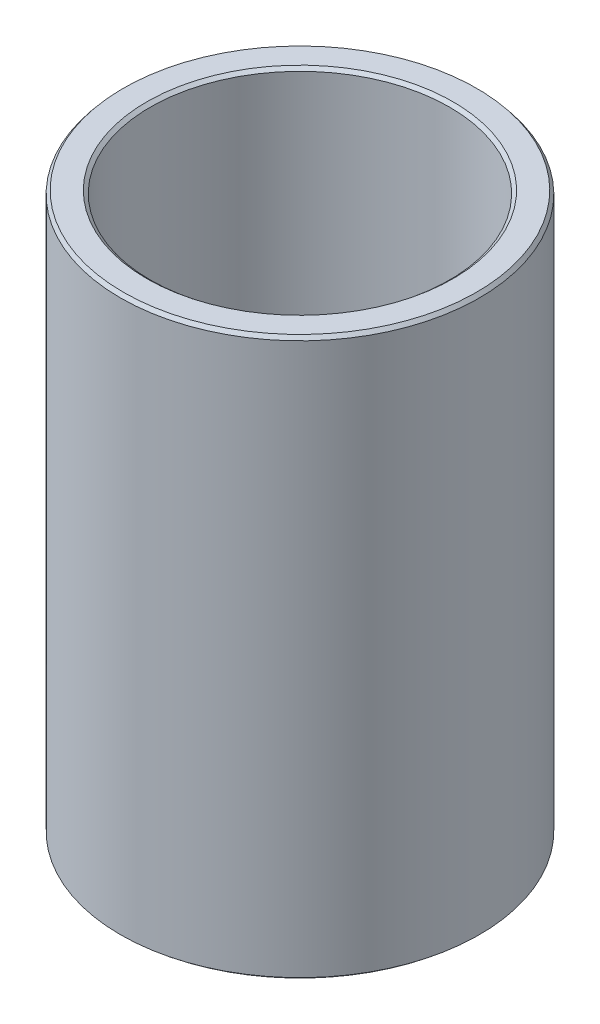
ISO-10303-21;
HEADER;
FILE_DESCRIPTION(('STEP AP214'),'2;1');
FILE_NAME('part.step','',(''),(''),'','','');
FILE_SCHEMA(('AUTOMOTIVE_DESIGN { 1 0 10303 214 1 1 1 1 }'));
ENDSEC;
DATA;
#1=APPLICATION_CONTEXT('core data for automotive mechanical design processes');
#2=APPLICATION_PROTOCOL_DEFINITION('international standard','automotive_design',2000,#1);
#3=PRODUCT_CONTEXT('',#1,'mechanical');
#4=PRODUCT('Part','Part','',(#3));
#5=PRODUCT_RELATED_PRODUCT_CATEGORY('part','',(#4));
#6=PRODUCT_DEFINITION_FORMATION('','',#4);
#7=PRODUCT_DEFINITION_CONTEXT('part definition',#1,'design');
#8=PRODUCT_DEFINITION('design','',#6,#7);
#9=PRODUCT_DEFINITION_SHAPE('','',#8);
#10=(LENGTH_UNIT() NAMED_UNIT(*) SI_UNIT(.MILLI.,.METRE.));
#11=(NAMED_UNIT(*) PLANE_ANGLE_UNIT() SI_UNIT($,.RADIAN.));
#12=(NAMED_UNIT(*) SI_UNIT($,.STERADIAN.) SOLID_ANGLE_UNIT());
#13=UNCERTAINTY_MEASURE_WITH_UNIT(LENGTH_MEASURE(1.E-05),#10,'distance_accuracy_value','');
#14=(GEOMETRIC_REPRESENTATION_CONTEXT(3) GLOBAL_UNCERTAINTY_ASSIGNED_CONTEXT((#13)) GLOBAL_UNIT_ASSIGNED_CONTEXT((#10,
#11,#12)) REPRESENTATION_CONTEXT('',''));
#15=CARTESIAN_POINT('',(0.,0.,0.));
#16=DIRECTION('',(0.,0.,1.));
#17=DIRECTION('',(1.,0.,0.));
#18=AXIS2_PLACEMENT_3D('',#15,#16,#17);
#19=CARTESIAN_POINT('',(0.,124.308796418235,0.));
#20=DIRECTION('',(0.,-1.,0.));
#21=DIRECTION('',(0.,0.,-1.));
#22=AXIS2_PLACEMENT_3D('',#19,#20,#21);
#23=CYLINDRICAL_SURFACE('',#22,40.);
#24=CARTESIAN_POINT('',(0.,0.638092898434306,0.));
#25=DIRECTION('',(0.,1.,0.));
#26=DIRECTION('',(0.,0.,1.));
#27=AXIS2_PLACEMENT_3D('',#24,#25,#26);
#28=CIRCLE('',#27,40.);
#29=CARTESIAN_POINT('',(0.,0.638092898434306,40.));
#30=VERTEX_POINT('',#29);
#31=EDGE_CURVE('E10',#30,#30,#28,.T.);
#32=ORIENTED_EDGE('',*,*,#31,.T.);
#33=EDGE_LOOP('',(#32));
#34=FACE_BOUND('',#33,.T.);
#35=CARTESIAN_POINT('',(0.,123.528594003098,0.));
#36=DIRECTION('',(0.,1.,0.));
#37=DIRECTION('',(0.,0.,1.));
#38=AXIS2_PLACEMENT_3D('',#35,#36,#37);
#39=CIRCLE('',#38,40.);
#40=CARTESIAN_POINT('',(0.,123.528594003098,40.));
#41=VERTEX_POINT('',#40);
#42=EDGE_CURVE('E50',#41,#41,#39,.F.);
#43=ORIENTED_EDGE('',*,*,#42,.T.);
#44=EDGE_LOOP('',(#43));
#45=FACE_BOUND('',#44,.T.);
#46=ADVANCED_FACE('F39',(#34,#45),#23,.T.);
#47=CARTESIAN_POINT('',(0.,124.308796418235,0.));
#48=DIRECTION('',(0.,1.,0.));
#49=DIRECTION('',(0.,0.,1.));
#50=AXIS2_PLACEMENT_3D('',#47,#48,#49);
#51=PLANE('',#50);
#52=CARTESIAN_POINT('',(0.,124.308796418235,0.));
#53=DIRECTION('',(0.,1.,0.));
#54=DIRECTION('',(0.,0.,1.));
#55=AXIS2_PLACEMENT_3D('',#52,#53,#54);
#56=CIRCLE('',#55,34.1356631452656);
#57=CARTESIAN_POINT('',(0.,124.308796418235,34.1356631452656));
#58=VERTEX_POINT('',#57);
#59=EDGE_CURVE('E58',#58,#58,#56,.F.);
#60=ORIENTED_EDGE('',*,*,#59,.T.);
#61=EDGE_LOOP('',(#60));
#62=FACE_BOUND('',#61,.T.);
#63=CARTESIAN_POINT('',(0.,124.308796418235,0.));
#64=DIRECTION('',(0.,1.,0.));
#65=DIRECTION('',(0.,0.,1.));
#66=AXIS2_PLACEMENT_3D('',#63,#64,#65);
#67=CIRCLE('',#66,39.3619071015657);
#68=CARTESIAN_POINT('',(0.,124.308796418235,39.3619071015657));
#69=VERTEX_POINT('',#68);
#70=EDGE_CURVE('E61',#69,#69,#67,.T.);
#71=ORIENTED_EDGE('',*,*,#70,.T.);
#72=EDGE_LOOP('',(#71));
#73=FACE_BOUND('',#72,.T.);
#74=ADVANCED_FACE('F88',(#62,#73),#51,.T.);
#75=CARTESIAN_POINT('',(0.,0.,0.));
#76=DIRECTION('',(0.,1.,0.));
#77=DIRECTION('',(0.,0.,1.));
#78=AXIS2_PLACEMENT_3D('',#75,#76,#77);
#79=PLANE('',#78);
#80=CARTESIAN_POINT('',(0.,0.,0.));
#81=DIRECTION('',(0.,1.,0.));
#82=DIRECTION('',(0.,0.,1.));
#83=AXIS2_PLACEMENT_3D('',#80,#81,#82);
#84=CIRCLE('',#83,33.9935536285621);
#85=CARTESIAN_POINT('',(0.,0.,33.9935536285621));
#86=VERTEX_POINT('',#85);
#87=EDGE_CURVE('E51',#86,#86,#84,.T.);
#88=ORIENTED_EDGE('',*,*,#87,.T.);
#89=EDGE_LOOP('',(#88));
#90=FACE_BOUND('',#89,.T.);
#91=CARTESIAN_POINT('',(0.,0.,0.));
#92=DIRECTION('',(0.,1.,0.));
#93=DIRECTION('',(0.,0.,1.));
#94=AXIS2_PLACEMENT_3D('',#91,#92,#93);
#95=CIRCLE('',#94,39.2197975848622);
#96=CARTESIAN_POINT('',(0.,0.,39.2197975848622));
#97=VERTEX_POINT('',#96);
#98=EDGE_CURVE('E54',#97,#97,#95,.F.);
#99=ORIENTED_EDGE('',*,*,#98,.T.);
#100=EDGE_LOOP('',(#99));
#101=FACE_BOUND('',#100,.T.);
#102=ADVANCED_FACE('F83',(#90,#101),#79,.F.);
#103=CARTESIAN_POINT('',(0.,124.308796418235,0.));
#104=DIRECTION('',(0.,-1.,0.));
#105=DIRECTION('',(0.,0.,-1.));
#106=AXIS2_PLACEMENT_3D('',#103,#104,#105);
#107=CYLINDRICAL_SURFACE('',#106,33.3554607301278);
#108=CARTESIAN_POINT('',(0.,123.670703519801,0.));
#109=DIRECTION('',(0.,1.,0.));
#110=DIRECTION('',(0.,0.,1.));
#111=AXIS2_PLACEMENT_3D('',#108,#109,#110);
#112=CIRCLE('',#111,33.3554607301278);
#113=CARTESIAN_POINT('',(0.,123.670703519801,33.3554607301278));
#114=VERTEX_POINT('',#113);
#115=EDGE_CURVE('E67',#114,#114,#112,.T.);
#116=ORIENTED_EDGE('',*,*,#115,.T.);
#117=EDGE_LOOP('',(#116));
#118=FACE_BOUND('',#117,.T.);
#119=CARTESIAN_POINT('',(0.,0.780202415137848,0.));
#120=DIRECTION('',(0.,1.,0.));
#121=DIRECTION('',(0.,0.,1.));
#122=AXIS2_PLACEMENT_3D('',#119,#120,#121);
#123=CIRCLE('',#122,33.3554607301278);
#124=CARTESIAN_POINT('',(0.,0.780202415137848,33.3554607301278));
#125=VERTEX_POINT('',#124);
#126=EDGE_CURVE('E69',#125,#125,#123,.F.);
#127=ORIENTED_EDGE('',*,*,#126,.T.);
#128=EDGE_LOOP('',(#127));
#129=FACE_BOUND('',#128,.T.);
#130=ADVANCED_FACE('F71',(#118,#129),#107,.F.);
#131=CARTESIAN_POINT('',(0.,123.670703519801,0.));
#132=DIRECTION('',(0.,1.,0.));
#133=DIRECTION('',(0.,0.,1.));
#134=AXIS2_PLACEMENT_3D('',#131,#132,#133);
#135=CONICAL_SURFACE('',#134,33.3554607301278,0.885262267280027);
#136=ORIENTED_EDGE('',*,*,#59,.F.);
#137=EDGE_LOOP('',(#136));
#138=FACE_BOUND('',#137,.T.);
#139=ORIENTED_EDGE('',*,*,#115,.F.);
#140=EDGE_LOOP('',(#139));
#141=FACE_BOUND('',#140,.T.);
#142=ADVANCED_FACE('F77',(#138,#141),#135,.F.);
#143=CARTESIAN_POINT('',(0.,0.,0.));
#144=DIRECTION('',(0.,-1.,0.));
#145=DIRECTION('',(0.,0.,-1.));
#146=AXIS2_PLACEMENT_3D('',#143,#144,#145);
#147=CONICAL_SURFACE('',#146,33.9935536285621,0.685534059514886);
#148=ORIENTED_EDGE('',*,*,#126,.F.);
#149=EDGE_LOOP('',(#148));
#150=FACE_BOUND('',#149,.T.);
#151=ORIENTED_EDGE('',*,*,#87,.F.);
#152=EDGE_LOOP('',(#151));
#153=FACE_BOUND('',#152,.T.);
#154=ADVANCED_FACE('F73',(#150,#153),#147,.F.);
#155=CARTESIAN_POINT('',(0.,0.638092898434306,0.));
#156=DIRECTION('',(0.,1.,0.));
#157=DIRECTION('',(0.,0.,1.));
#158=AXIS2_PLACEMENT_3D('',#155,#156,#157);
#159=CONICAL_SURFACE('',#158,40.,0.885262267280019);
#160=ORIENTED_EDGE('',*,*,#98,.F.);
#161=EDGE_LOOP('',(#160));
#162=FACE_BOUND('',#161,.T.);
#163=ORIENTED_EDGE('',*,*,#31,.F.);
#164=EDGE_LOOP('',(#163));
#165=FACE_BOUND('',#164,.T.);
#166=ADVANCED_FACE('F76',(#162,#165),#159,.T.);
#167=CARTESIAN_POINT('',(0.,124.308796418235,0.));
#168=DIRECTION('',(0.,-1.,0.));
#169=DIRECTION('',(0.,0.,-1.));
#170=AXIS2_PLACEMENT_3D('',#167,#168,#169);
#171=CONICAL_SURFACE('',#170,39.3619071015657,0.685534059514883);
#172=ORIENTED_EDGE('',*,*,#42,.F.);
#173=EDGE_LOOP('',(#172));
#174=FACE_BOUND('',#173,.T.);
#175=ORIENTED_EDGE('',*,*,#70,.F.);
#176=EDGE_LOOP('',(#175));
#177=FACE_BOUND('',#176,.T.);
#178=ADVANCED_FACE('F45',(#174,#177),#171,.T.);
#179=CLOSED_SHELL('',(#46,#74,#102,#130,#142,#154,#166,#178));
#180=MANIFOLD_SOLID_BREP('B2',#179);
#181=ADVANCED_BREP_SHAPE_REPRESENTATION('',(#18,#180),#14);
#182=SHAPE_DEFINITION_REPRESENTATION(#9,#181);
ENDSEC;
END-ISO-10303-21;
